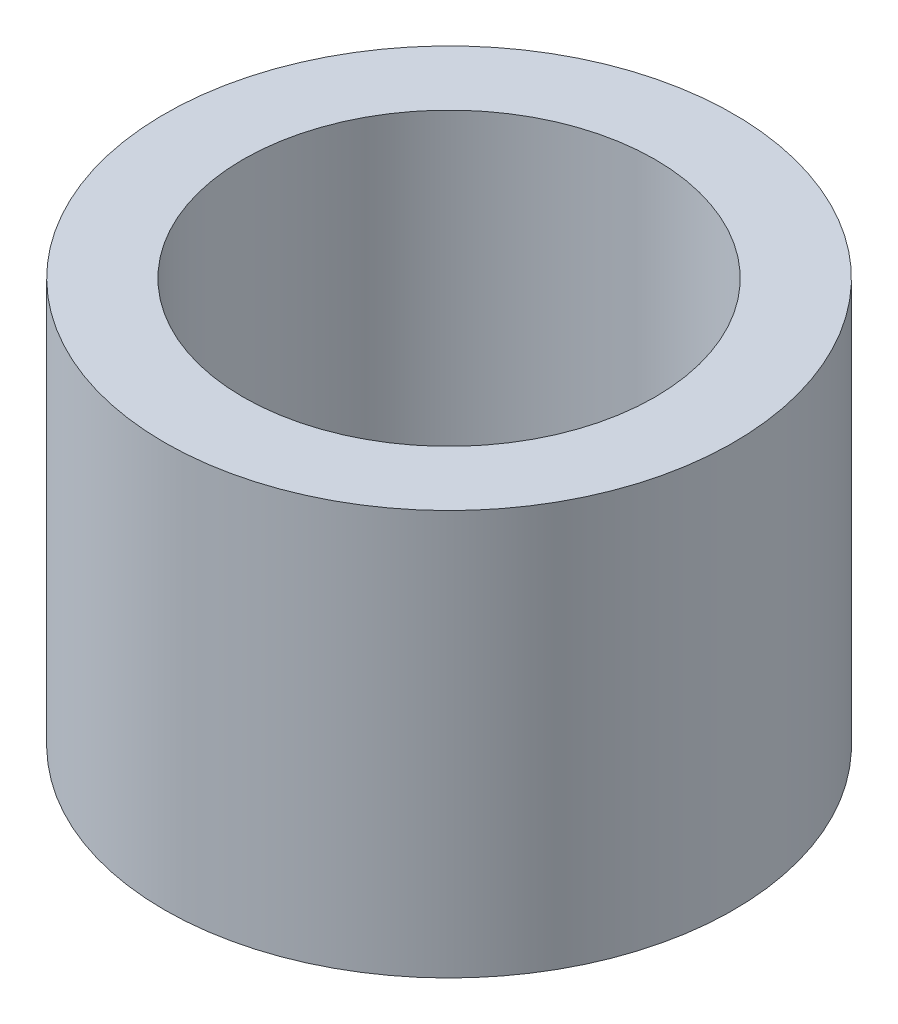
ISO-10303-21;
HEADER;
FILE_DESCRIPTION(('STEP AP214'),'2;1');
FILE_NAME('part.step','',(''),(''),'','','');
FILE_SCHEMA(('AUTOMOTIVE_DESIGN { 1 0 10303 214 1 1 1 1 }'));
ENDSEC;
DATA;
#1=APPLICATION_CONTEXT('core data for automotive mechanical design processes');
#2=APPLICATION_PROTOCOL_DEFINITION('international standard','automotive_design',2000,#1);
#3=PRODUCT_CONTEXT('',#1,'mechanical');
#4=PRODUCT('Part','Part','',(#3));
#5=PRODUCT_RELATED_PRODUCT_CATEGORY('part','',(#4));
#6=PRODUCT_DEFINITION_FORMATION('','',#4);
#7=PRODUCT_DEFINITION_CONTEXT('part definition',#1,'design');
#8=PRODUCT_DEFINITION('design','',#6,#7);
#9=PRODUCT_DEFINITION_SHAPE('','',#8);
#10=(LENGTH_UNIT() NAMED_UNIT(*) SI_UNIT(.MILLI.,.METRE.));
#11=(NAMED_UNIT(*) PLANE_ANGLE_UNIT() SI_UNIT($,.RADIAN.));
#12=(NAMED_UNIT(*) SI_UNIT($,.STERADIAN.) SOLID_ANGLE_UNIT());
#13=UNCERTAINTY_MEASURE_WITH_UNIT(LENGTH_MEASURE(1.E-05),#10,'distance_accuracy_value','');
#14=(GEOMETRIC_REPRESENTATION_CONTEXT(3) GLOBAL_UNCERTAINTY_ASSIGNED_CONTEXT((#13)) GLOBAL_UNIT_ASSIGNED_CONTEXT((#10,
#11,#12)) REPRESENTATION_CONTEXT('',''));
#15=CARTESIAN_POINT('',(0.,0.,0.));
#16=DIRECTION('',(0.,0.,1.));
#17=DIRECTION('',(1.,0.,0.));
#18=AXIS2_PLACEMENT_3D('',#15,#16,#17);
#19=CARTESIAN_POINT('',(0.,32.0110792260367,0.));
#20=DIRECTION('',(0.,-1.,0.));
#21=DIRECTION('',(0.,0.,-1.));
#22=AXIS2_PLACEMENT_3D('',#19,#20,#21);
#23=CYLINDRICAL_SURFACE('',#22,22.5);
#24=CARTESIAN_POINT('',(0.,32.0110792260367,0.));
#25=DIRECTION('',(0.,1.,0.));
#26=DIRECTION('',(0.,0.,1.));
#27=AXIS2_PLACEMENT_3D('',#24,#25,#26);
#28=CIRCLE('',#27,22.5);
#29=CARTESIAN_POINT('',(0.,32.0110792260367,22.5));
#30=VERTEX_POINT('',#29);
#31=EDGE_CURVE('E10',#30,#30,#28,.T.);
#32=ORIENTED_EDGE('',*,*,#31,.F.);
#33=EDGE_LOOP('',(#32));
#34=FACE_BOUND('',#33,.T.);
#35=CARTESIAN_POINT('',(0.,0.,0.));
#36=DIRECTION('',(0.,1.,0.));
#37=DIRECTION('',(0.,0.,1.));
#38=AXIS2_PLACEMENT_3D('',#35,#36,#37);
#39=CIRCLE('',#38,22.5);
#40=CARTESIAN_POINT('',(0.,0.,22.5));
#41=VERTEX_POINT('',#40);
#42=EDGE_CURVE('E37',#41,#41,#39,.T.);
#43=ORIENTED_EDGE('',*,*,#42,.T.);
#44=EDGE_LOOP('',(#43));
#45=FACE_BOUND('',#44,.T.);
#46=ADVANCED_FACE('F40',(#34,#45),#23,.T.);
#47=CARTESIAN_POINT('',(0.,32.0110792260367,0.));
#48=DIRECTION('',(0.,1.,0.));
#49=DIRECTION('',(0.,0.,1.));
#50=AXIS2_PLACEMENT_3D('',#47,#48,#49);
#51=PLANE('',#50);
#52=CARTESIAN_POINT('',(0.,32.0110792260367,0.));
#53=DIRECTION('',(0.,1.,0.));
#54=DIRECTION('',(0.,0.,1.));
#55=AXIS2_PLACEMENT_3D('',#52,#53,#54);
#56=CIRCLE('',#55,16.2830052794063);
#57=CARTESIAN_POINT('',(0.,32.0110792260367,16.2830052794063));
#58=VERTEX_POINT('',#57);
#59=EDGE_CURVE('E50',#58,#58,#56,.T.);
#60=ORIENTED_EDGE('',*,*,#59,.F.);
#61=EDGE_LOOP('',(#60));
#62=FACE_BOUND('',#61,.T.);
#63=ORIENTED_EDGE('',*,*,#31,.T.);
#64=EDGE_LOOP('',(#63));
#65=FACE_BOUND('',#64,.T.);
#66=ADVANCED_FACE('F59',(#62,#65),#51,.T.);
#67=CARTESIAN_POINT('',(0.,0.,0.));
#68=DIRECTION('',(0.,1.,0.));
#69=DIRECTION('',(0.,0.,1.));
#70=AXIS2_PLACEMENT_3D('',#67,#68,#69);
#71=PLANE('',#70);
#72=CARTESIAN_POINT('',(0.,0.,0.));
#73=DIRECTION('',(0.,1.,0.));
#74=DIRECTION('',(0.,0.,1.));
#75=AXIS2_PLACEMENT_3D('',#72,#73,#74);
#76=CIRCLE('',#75,16.2830052794063);
#77=CARTESIAN_POINT('',(0.,0.,16.2830052794063));
#78=VERTEX_POINT('',#77);
#79=EDGE_CURVE('E47',#78,#78,#76,.T.);
#80=ORIENTED_EDGE('',*,*,#79,.T.);
#81=EDGE_LOOP('',(#80));
#82=FACE_BOUND('',#81,.T.);
#83=ORIENTED_EDGE('',*,*,#42,.F.);
#84=EDGE_LOOP('',(#83));
#85=FACE_BOUND('',#84,.T.);
#86=ADVANCED_FACE('F58',(#82,#85),#71,.F.);
#87=CARTESIAN_POINT('',(0.,32.0110792260367,0.));
#88=DIRECTION('',(0.,-1.,0.));
#89=DIRECTION('',(0.,0.,-1.));
#90=AXIS2_PLACEMENT_3D('',#87,#88,#89);
#91=CYLINDRICAL_SURFACE('',#90,16.2830052794063);
#92=ORIENTED_EDGE('',*,*,#59,.T.);
#93=EDGE_LOOP('',(#92));
#94=FACE_BOUND('',#93,.T.);
#95=ORIENTED_EDGE('',*,*,#79,.F.);
#96=EDGE_LOOP('',(#95));
#97=FACE_BOUND('',#96,.T.);
#98=ADVANCED_FACE('F54',(#94,#97),#91,.F.);
#99=CLOSED_SHELL('',(#46,#66,#86,#98));
#100=MANIFOLD_SOLID_BREP('B2',#99);
#101=ADVANCED_BREP_SHAPE_REPRESENTATION('',(#18,#100),#14);
#102=SHAPE_DEFINITION_REPRESENTATION(#9,#101);
ENDSEC;
END-ISO-10303-21;
